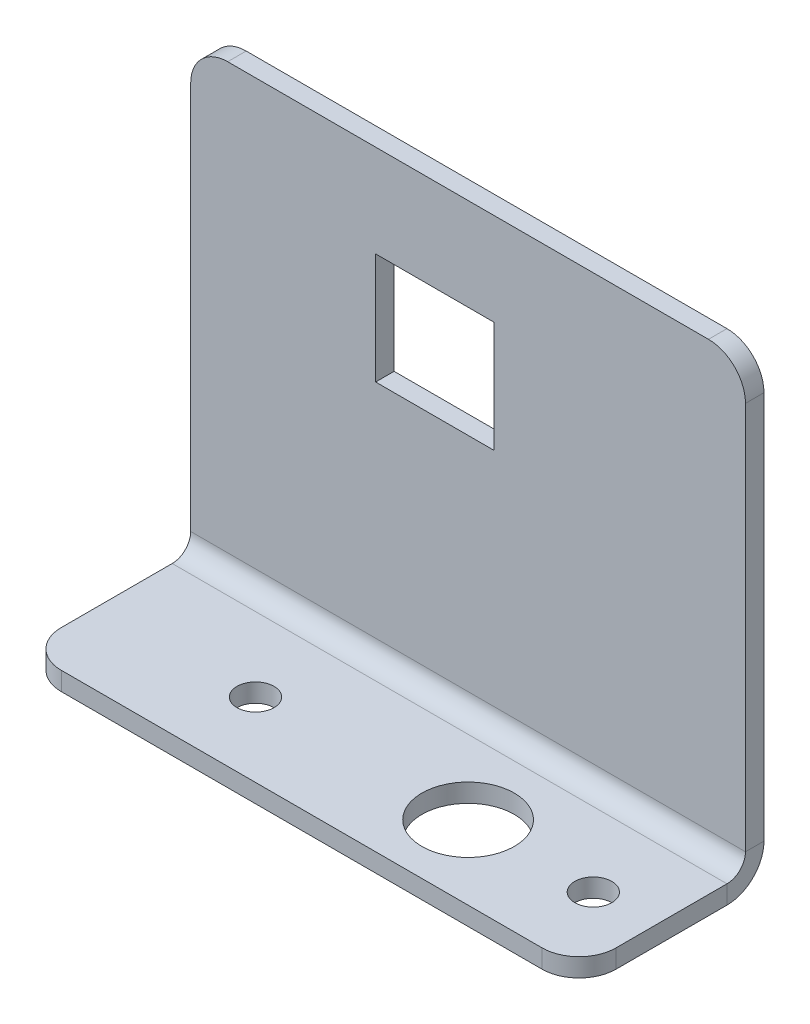
ISO-10303-21;
HEADER;
FILE_DESCRIPTION(('STEP AP214'),'2;1');
FILE_NAME('part.step','',(''),(''),'','','');
FILE_SCHEMA(('AUTOMOTIVE_DESIGN { 1 0 10303 214 1 1 1 1 }'));
ENDSEC;
DATA;
#1=APPLICATION_CONTEXT('core data for automotive mechanical design processes');
#2=APPLICATION_PROTOCOL_DEFINITION('international standard','automotive_design',2000,#1);
#3=PRODUCT_CONTEXT('',#1,'mechanical');
#4=PRODUCT('Part','Part','',(#3));
#5=PRODUCT_RELATED_PRODUCT_CATEGORY('part','',(#4));
#6=PRODUCT_DEFINITION_FORMATION('','',#4);
#7=PRODUCT_DEFINITION_CONTEXT('part definition',#1,'design');
#8=PRODUCT_DEFINITION('design','',#6,#7);
#9=PRODUCT_DEFINITION_SHAPE('','',#8);
#10=(LENGTH_UNIT() NAMED_UNIT(*) SI_UNIT(.MILLI.,.METRE.));
#11=(NAMED_UNIT(*) PLANE_ANGLE_UNIT() SI_UNIT($,.RADIAN.));
#12=(NAMED_UNIT(*) SI_UNIT($,.STERADIAN.) SOLID_ANGLE_UNIT());
#13=UNCERTAINTY_MEASURE_WITH_UNIT(LENGTH_MEASURE(1.E-05),#10,'distance_accuracy_value','');
#14=(GEOMETRIC_REPRESENTATION_CONTEXT(3) GLOBAL_UNCERTAINTY_ASSIGNED_CONTEXT((#13)) GLOBAL_UNIT_ASSIGNED_CONTEXT((#10,
#11,#12)) REPRESENTATION_CONTEXT('',''));
#15=CARTESIAN_POINT('',(0.,0.,0.));
#16=DIRECTION('',(0.,0.,1.));
#17=DIRECTION('',(1.,0.,0.));
#18=AXIS2_PLACEMENT_3D('',#15,#16,#17);
#19=CARTESIAN_POINT('',(0.,1.27,-11.43));
#20=DIRECTION('',(1.,0.,0.));
#21=DIRECTION('',(0.,0.,1.));
#22=AXIS2_PLACEMENT_3D('',#19,#20,#21);
#23=PLANE('',#22);
#24=DIRECTION('',(0.,0.,-1.));
#25=VECTOR('',#24,1.);
#26=CARTESIAN_POINT('',(0.,0.,-11.43));
#27=LINE('',#26,#25);
#28=CARTESIAN_POINT('',(0.,0.,-10.16));
#29=VERTEX_POINT('',#28);
#30=CARTESIAN_POINT('',(0.,0.,-2.54));
#31=VERTEX_POINT('',#30);
#32=EDGE_CURVE('E231',#29,#31,#27,.F.);
#33=ORIENTED_EDGE('',*,*,#32,.T.);
#34=DIRECTION('',(0.,1.,0.));
#35=VECTOR('',#34,1.);
#36=CARTESIAN_POINT('',(0.,1.27,-2.54));
#37=LINE('',#36,#35);
#38=CARTESIAN_POINT('',(0.,1.27,-2.54));
#39=VERTEX_POINT('',#38);
#40=EDGE_CURVE('E273',#31,#39,#37,.T.);
#41=ORIENTED_EDGE('',*,*,#40,.T.);
#42=DIRECTION('',(0.,0.,1.));
#43=VECTOR('',#42,1.);
#44=CARTESIAN_POINT('',(0.,1.27,-11.43));
#45=LINE('',#44,#43);
#46=CARTESIAN_POINT('',(0.,1.27,-10.16));
#47=VERTEX_POINT('',#46);
#48=EDGE_CURVE('E205',#47,#39,#45,.T.);
#49=ORIENTED_EDGE('',*,*,#48,.F.);
#50=DIRECTION('',(0.,1.,0.));
#51=VECTOR('',#50,1.);
#52=CARTESIAN_POINT('',(0.,1.27,-10.16));
#53=LINE('',#52,#51);
#54=EDGE_CURVE('E251',#29,#47,#53,.T.);
#55=ORIENTED_EDGE('',*,*,#54,.F.);
#56=EDGE_LOOP('',(#33,#41,#49,#55));
#57=FACE_BOUND('',#56,.T.);
#58=ADVANCED_FACE('F38',(#57),#23,.F.);
#59=CARTESIAN_POINT('',(38.1,1.27,0.));
#60=DIRECTION('',(0.,0.,1.));
#61=DIRECTION('',(-1.,0.,0.));
#62=AXIS2_PLACEMENT_3D('',#59,#60,#61);
#63=PLANE('',#62);
#64=DIRECTION('',(-1.,0.,0.));
#65=VECTOR('',#64,1.);
#66=CARTESIAN_POINT('',(38.1,1.27,0.));
#67=LINE('',#66,#65);
#68=CARTESIAN_POINT('',(35.56,1.27,0.));
#69=VERTEX_POINT('',#68);
#70=CARTESIAN_POINT('',(2.54000000000001,1.27,0.));
#71=VERTEX_POINT('',#70);
#72=EDGE_CURVE('E299',#69,#71,#67,.T.);
#73=ORIENTED_EDGE('',*,*,#72,.T.);
#74=DIRECTION('',(0.,-1.,0.));
#75=VECTOR('',#74,1.);
#76=CARTESIAN_POINT('',(2.54,1.27,0.));
#77=LINE('',#76,#75);
#78=CARTESIAN_POINT('',(2.54,0.,0.));
#79=VERTEX_POINT('',#78);
#80=EDGE_CURVE('E59',#71,#79,#77,.T.);
#81=ORIENTED_EDGE('',*,*,#80,.T.);
#82=DIRECTION('',(1.,0.,0.));
#83=VECTOR('',#82,1.);
#84=CARTESIAN_POINT('',(38.1,0.,0.));
#85=LINE('',#84,#83);
#86=CARTESIAN_POINT('',(35.56,0.,0.));
#87=VERTEX_POINT('',#86);
#88=EDGE_CURVE('E234',#87,#79,#85,.F.);
#89=ORIENTED_EDGE('',*,*,#88,.F.);
#90=DIRECTION('',(0.,1.,0.));
#91=VECTOR('',#90,1.);
#92=CARTESIAN_POINT('',(35.56,1.27,0.));
#93=LINE('',#92,#91);
#94=EDGE_CURVE('E280',#87,#69,#93,.T.);
#95=ORIENTED_EDGE('',*,*,#94,.T.);
#96=EDGE_LOOP('',(#73,#81,#89,#95));
#97=FACE_BOUND('',#96,.T.);
#98=ADVANCED_FACE('F300',(#97),#63,.T.);
#99=CARTESIAN_POINT('',(38.1,1.27,-11.43));
#100=DIRECTION('',(1.,0.,0.));
#101=DIRECTION('',(0.,0.,1.));
#102=AXIS2_PLACEMENT_3D('',#99,#100,#101);
#103=PLANE('',#102);
#104=DIRECTION('',(0.,0.,1.));
#105=VECTOR('',#104,1.);
#106=CARTESIAN_POINT('',(38.1,1.27,-11.43));
#107=LINE('',#106,#105);
#108=CARTESIAN_POINT('',(38.1,1.27,-10.16));
#109=VERTEX_POINT('',#108);
#110=CARTESIAN_POINT('',(38.1,1.27,-2.54));
#111=VERTEX_POINT('',#110);
#112=EDGE_CURVE('E176',#109,#111,#107,.T.);
#113=ORIENTED_EDGE('',*,*,#112,.T.);
#114=DIRECTION('',(0.,1.,0.));
#115=VECTOR('',#114,1.);
#116=CARTESIAN_POINT('',(38.1,1.27,-2.54));
#117=LINE('',#116,#115);
#118=CARTESIAN_POINT('',(38.1,0.,-2.54));
#119=VERTEX_POINT('',#118);
#120=EDGE_CURVE('E11',#111,#119,#117,.F.);
#121=ORIENTED_EDGE('',*,*,#120,.T.);
#122=DIRECTION('',(0.,0.,-1.));
#123=VECTOR('',#122,1.);
#124=CARTESIAN_POINT('',(38.1,0.,-11.43));
#125=LINE('',#124,#123);
#126=CARTESIAN_POINT('',(38.1,0.,-10.16));
#127=VERTEX_POINT('',#126);
#128=EDGE_CURVE('E214',#127,#119,#125,.F.);
#129=ORIENTED_EDGE('',*,*,#128,.F.);
#130=DIRECTION('',(0.,1.,0.));
#131=VECTOR('',#130,1.);
#132=CARTESIAN_POINT('',(38.1,1.27,-10.16));
#133=LINE('',#132,#131);
#134=EDGE_CURVE('E249',#127,#109,#133,.T.);
#135=ORIENTED_EDGE('',*,*,#134,.T.);
#136=EDGE_LOOP('',(#113,#121,#129,#135));
#137=FACE_BOUND('',#136,.T.);
#138=ADVANCED_FACE('F360',(#137),#103,.T.);
#139=CARTESIAN_POINT('',(38.1,2.54,-10.16));
#140=DIRECTION('',(1.,0.,0.));
#141=DIRECTION('',(0.,0.,-1.));
#142=AXIS2_PLACEMENT_3D('',#139,#140,#141);
#143=PLANE('',#142);
#144=ORIENTED_EDGE('',*,*,#134,.F.);
#145=CARTESIAN_POINT('',(38.1,2.54,-10.16));
#146=DIRECTION('',(1.,0.,0.));
#147=DIRECTION('',(0.,0.,-1.));
#148=AXIS2_PLACEMENT_3D('',#145,#146,#147);
#149=CIRCLE('',#148,2.54);
#150=CARTESIAN_POINT('',(38.1,2.54,-12.7));
#151=VERTEX_POINT('',#150);
#152=EDGE_CURVE('E228',#127,#151,#149,.T.);
#153=ORIENTED_EDGE('',*,*,#152,.T.);
#154=DIRECTION('',(0.,0.,1.));
#155=VECTOR('',#154,1.);
#156=CARTESIAN_POINT('',(38.1,2.54,-11.43));
#157=LINE('',#156,#155);
#158=CARTESIAN_POINT('',(38.1,2.54,-11.43));
#159=VERTEX_POINT('',#158);
#160=EDGE_CURVE('E246',#151,#159,#157,.T.);
#161=ORIENTED_EDGE('',*,*,#160,.T.);
#162=CARTESIAN_POINT('',(38.1,2.54,-10.16));
#163=DIRECTION('',(-1.,0.,0.));
#164=DIRECTION('',(0.,0.,1.));
#165=AXIS2_PLACEMENT_3D('',#162,#163,#164);
#166=CIRCLE('',#165,1.27);
#167=EDGE_CURVE('E201',#109,#159,#166,.F.);
#168=ORIENTED_EDGE('',*,*,#167,.F.);
#169=EDGE_LOOP('',(#144,#153,#161,#168));
#170=FACE_BOUND('',#169,.T.);
#171=ADVANCED_FACE('F387',(#170),#143,.T.);
#172=CARTESIAN_POINT('',(38.1,31.75,-11.43));
#173=DIRECTION('',(1.,0.,0.));
#174=DIRECTION('',(0.,-1.,0.));
#175=AXIS2_PLACEMENT_3D('',#172,#173,#174);
#176=PLANE('',#175);
#177=DIRECTION('',(0.,1.,0.));
#178=VECTOR('',#177,1.);
#179=CARTESIAN_POINT('',(38.1,31.75,-12.7));
#180=LINE('',#179,#178);
#181=CARTESIAN_POINT('',(38.1,29.21,-12.7));
#182=VERTEX_POINT('',#181);
#183=EDGE_CURVE('E224',#182,#151,#180,.F.);
#184=ORIENTED_EDGE('',*,*,#183,.F.);
#185=DIRECTION('',(0.,0.,-1.));
#186=VECTOR('',#185,1.);
#187=CARTESIAN_POINT('',(38.1,29.21,-11.43));
#188=LINE('',#187,#186);
#189=CARTESIAN_POINT('',(38.1,29.21,-11.43));
#190=VERTEX_POINT('',#189);
#191=EDGE_CURVE('E253',#182,#190,#188,.F.);
#192=ORIENTED_EDGE('',*,*,#191,.T.);
#193=DIRECTION('',(0.,-1.,0.));
#194=VECTOR('',#193,1.);
#195=CARTESIAN_POINT('',(38.1,31.75,-11.43));
#196=LINE('',#195,#194);
#197=EDGE_CURVE('E188',#190,#159,#196,.T.);
#198=ORIENTED_EDGE('',*,*,#197,.T.);
#199=ORIENTED_EDGE('',*,*,#160,.F.);
#200=EDGE_LOOP('',(#184,#192,#198,#199));
#201=FACE_BOUND('',#200,.T.);
#202=ADVANCED_FACE('F403',(#201),#176,.T.);
#203=CARTESIAN_POINT('',(38.1,31.75,-11.43));
#204=DIRECTION('',(0.,-1.,0.));
#205=DIRECTION('',(-1.,0.,0.));
#206=AXIS2_PLACEMENT_3D('',#203,#204,#205);
#207=PLANE('',#206);
#208=DIRECTION('',(-1.,0.,0.));
#209=VECTOR('',#208,1.);
#210=CARTESIAN_POINT('',(38.1,31.75,-11.43));
#211=LINE('',#210,#209);
#212=CARTESIAN_POINT('',(35.56,31.75,-11.43));
#213=VERTEX_POINT('',#212);
#214=CARTESIAN_POINT('',(2.54000000000001,31.75,-11.43));
#215=VERTEX_POINT('',#214);
#216=EDGE_CURVE('E190',#213,#215,#211,.T.);
#217=ORIENTED_EDGE('',*,*,#216,.F.);
#218=DIRECTION('',(0.,0.,1.));
#219=VECTOR('',#218,1.);
#220=CARTESIAN_POINT('',(35.56,31.75,-11.43));
#221=LINE('',#220,#219);
#222=CARTESIAN_POINT('',(35.56,31.75,-12.7));
#223=VERTEX_POINT('',#222);
#224=EDGE_CURVE('E265',#213,#223,#221,.F.);
#225=ORIENTED_EDGE('',*,*,#224,.T.);
#226=DIRECTION('',(1.,0.,0.));
#227=VECTOR('',#226,1.);
#228=CARTESIAN_POINT('',(38.1,31.75,-12.7));
#229=LINE('',#228,#227);
#230=CARTESIAN_POINT('',(2.54000000000001,31.75,-12.7));
#231=VERTEX_POINT('',#230);
#232=EDGE_CURVE('E211',#223,#231,#229,.F.);
#233=ORIENTED_EDGE('',*,*,#232,.T.);
#234=DIRECTION('',(0.,0.,-1.));
#235=VECTOR('',#234,1.);
#236=CARTESIAN_POINT('',(2.54,31.75,-11.43));
#237=LINE('',#236,#235);
#238=EDGE_CURVE('E262',#231,#215,#237,.F.);
#239=ORIENTED_EDGE('',*,*,#238,.T.);
#240=EDGE_LOOP('',(#217,#225,#233,#239));
#241=FACE_BOUND('',#240,.T.);
#242=ADVANCED_FACE('F412',(#241),#207,.F.);
#243=CARTESIAN_POINT('',(0.,31.75,-11.43));
#244=DIRECTION('',(1.,0.,0.));
#245=DIRECTION('',(0.,-1.,0.));
#246=AXIS2_PLACEMENT_3D('',#243,#244,#245);
#247=PLANE('',#246);
#248=DIRECTION('',(0.,-1.,0.));
#249=VECTOR('',#248,1.);
#250=CARTESIAN_POINT('',(0.,31.75,-11.43));
#251=LINE('',#250,#249);
#252=CARTESIAN_POINT('',(0.,29.21,-11.43));
#253=VERTEX_POINT('',#252);
#254=CARTESIAN_POINT('',(0.,2.54,-11.43));
#255=VERTEX_POINT('',#254);
#256=EDGE_CURVE('E186',#253,#255,#251,.T.);
#257=ORIENTED_EDGE('',*,*,#256,.F.);
#258=DIRECTION('',(0.,0.,-1.));
#259=VECTOR('',#258,1.);
#260=CARTESIAN_POINT('',(0.,29.21,-11.43));
#261=LINE('',#260,#259);
#262=CARTESIAN_POINT('',(0.,29.21,-12.7));
#263=VERTEX_POINT('',#262);
#264=EDGE_CURVE('E271',#253,#263,#261,.T.);
#265=ORIENTED_EDGE('',*,*,#264,.T.);
#266=DIRECTION('',(0.,1.,0.));
#267=VECTOR('',#266,1.);
#268=CARTESIAN_POINT('',(0.,31.75,-12.7));
#269=LINE('',#268,#267);
#270=CARTESIAN_POINT('',(0.,2.54,-12.7));
#271=VERTEX_POINT('',#270);
#272=EDGE_CURVE('E218',#263,#271,#269,.F.);
#273=ORIENTED_EDGE('',*,*,#272,.T.);
#274=DIRECTION('',(0.,0.,1.));
#275=VECTOR('',#274,1.);
#276=CARTESIAN_POINT('',(0.,2.54,-11.43));
#277=LINE('',#276,#275);
#278=EDGE_CURVE('E244',#271,#255,#277,.T.);
#279=ORIENTED_EDGE('',*,*,#278,.T.);
#280=EDGE_LOOP('',(#257,#265,#273,#279));
#281=FACE_BOUND('',#280,.T.);
#282=ADVANCED_FACE('F409',(#281),#247,.F.);
#283=CARTESIAN_POINT('',(38.1,17.78,-11.43));
#284=DIRECTION('',(0.,-1.,0.));
#285=DIRECTION('',(-1.,0.,0.));
#286=AXIS2_PLACEMENT_3D('',#283,#284,#285);
#287=PLANE('',#286);
#288=DIRECTION('',(0.,0.,1.));
#289=VECTOR('',#288,1.);
#290=CARTESIAN_POINT('',(20.828,17.78,-11.43));
#291=LINE('',#290,#289);
#292=CARTESIAN_POINT('',(20.828,17.78,-12.7));
#293=VERTEX_POINT('',#292);
#294=CARTESIAN_POINT('',(20.828,17.78,-11.43));
#295=VERTEX_POINT('',#294);
#296=EDGE_CURVE('E179',#293,#295,#291,.T.);
#297=ORIENTED_EDGE('',*,*,#296,.F.);
#298=DIRECTION('',(1.,0.,0.));
#299=VECTOR('',#298,1.);
#300=CARTESIAN_POINT('',(38.1,17.78,-12.7));
#301=LINE('',#300,#299);
#302=CARTESIAN_POINT('',(12.7,17.78,-12.7));
#303=VERTEX_POINT('',#302);
#304=EDGE_CURVE('E219',#293,#303,#301,.F.);
#305=ORIENTED_EDGE('',*,*,#304,.T.);
#306=DIRECTION('',(0.,0.,1.));
#307=VECTOR('',#306,1.);
#308=CARTESIAN_POINT('',(12.7,17.78,-11.43));
#309=LINE('',#308,#307);
#310=CARTESIAN_POINT('',(12.7,17.78,-11.43));
#311=VERTEX_POINT('',#310);
#312=EDGE_CURVE('E242',#303,#311,#309,.T.);
#313=ORIENTED_EDGE('',*,*,#312,.T.);
#314=DIRECTION('',(-1.,0.,0.));
#315=VECTOR('',#314,1.);
#316=CARTESIAN_POINT('',(38.1,17.78,-11.43));
#317=LINE('',#316,#315);
#318=EDGE_CURVE('E180',#295,#311,#317,.T.);
#319=ORIENTED_EDGE('',*,*,#318,.F.);
#320=EDGE_LOOP('',(#297,#305,#313,#319));
#321=FACE_BOUND('',#320,.T.);
#322=ADVANCED_FACE('F420',(#321),#287,.F.);
#323=CARTESIAN_POINT('',(12.7,31.75,-11.43));
#324=DIRECTION('',(-1.,0.,0.));
#325=DIRECTION('',(0.,1.,0.));
#326=AXIS2_PLACEMENT_3D('',#323,#324,#325);
#327=PLANE('',#326);
#328=ORIENTED_EDGE('',*,*,#312,.F.);
#329=DIRECTION('',(0.,1.,0.));
#330=VECTOR('',#329,1.);
#331=CARTESIAN_POINT('',(12.7,31.75,-12.7));
#332=LINE('',#331,#330);
#333=CARTESIAN_POINT('',(12.7,25.4,-12.7));
#334=VERTEX_POINT('',#333);
#335=EDGE_CURVE('E215',#303,#334,#332,.T.);
#336=ORIENTED_EDGE('',*,*,#335,.T.);
#337=DIRECTION('',(0.,0.,1.));
#338=VECTOR('',#337,1.);
#339=CARTESIAN_POINT('',(12.7,25.4,-11.43));
#340=LINE('',#339,#338);
#341=CARTESIAN_POINT('',(12.7,25.4,-11.43));
#342=VERTEX_POINT('',#341);
#343=EDGE_CURVE('E164',#334,#342,#340,.T.);
#344=ORIENTED_EDGE('',*,*,#343,.T.);
#345=DIRECTION('',(0.,1.,0.));
#346=VECTOR('',#345,1.);
#347=CARTESIAN_POINT('',(12.7,31.75,-11.43));
#348=LINE('',#347,#346);
#349=EDGE_CURVE('E175',#311,#342,#348,.T.);
#350=ORIENTED_EDGE('',*,*,#349,.F.);
#351=EDGE_LOOP('',(#328,#336,#344,#350));
#352=FACE_BOUND('',#351,.T.);
#353=ADVANCED_FACE('F601',(#352),#327,.F.);
#354=CARTESIAN_POINT('',(38.1,25.4,-11.43));
#355=DIRECTION('',(0.,1.,0.));
#356=DIRECTION('',(1.,0.,0.));
#357=AXIS2_PLACEMENT_3D('',#354,#355,#356);
#358=PLANE('',#357);
#359=ORIENTED_EDGE('',*,*,#343,.F.);
#360=DIRECTION('',(1.,0.,0.));
#361=VECTOR('',#360,1.);
#362=CARTESIAN_POINT('',(38.1,25.4,-12.7));
#363=LINE('',#362,#361);
#364=CARTESIAN_POINT('',(20.828,25.4,-12.7));
#365=VERTEX_POINT('',#364);
#366=EDGE_CURVE('E159',#334,#365,#363,.T.);
#367=ORIENTED_EDGE('',*,*,#366,.T.);
#368=DIRECTION('',(0.,0.,1.));
#369=VECTOR('',#368,1.);
#370=CARTESIAN_POINT('',(20.828,25.4,-11.43));
#371=LINE('',#370,#369);
#372=CARTESIAN_POINT('',(20.828,25.4,-11.43));
#373=VERTEX_POINT('',#372);
#374=EDGE_CURVE('E153',#365,#373,#371,.T.);
#375=ORIENTED_EDGE('',*,*,#374,.T.);
#376=DIRECTION('',(1.,0.,0.));
#377=VECTOR('',#376,1.);
#378=CARTESIAN_POINT('',(38.1,25.4,-11.43));
#379=LINE('',#378,#377);
#380=EDGE_CURVE('E156',#342,#373,#379,.T.);
#381=ORIENTED_EDGE('',*,*,#380,.F.);
#382=EDGE_LOOP('',(#359,#367,#375,#381));
#383=FACE_BOUND('',#382,.T.);
#384=ADVANCED_FACE('F155',(#383),#358,.F.);
#385=CARTESIAN_POINT('',(20.828,31.75,-11.43));
#386=DIRECTION('',(1.,0.,0.));
#387=DIRECTION('',(0.,-1.,0.));
#388=AXIS2_PLACEMENT_3D('',#385,#386,#387);
#389=PLANE('',#388);
#390=DIRECTION('',(0.,1.,0.));
#391=VECTOR('',#390,1.);
#392=CARTESIAN_POINT('',(20.828,31.75,-12.7));
#393=LINE('',#392,#391);
#394=EDGE_CURVE('E213',#365,#293,#393,.F.);
#395=ORIENTED_EDGE('',*,*,#394,.T.);
#396=ORIENTED_EDGE('',*,*,#296,.T.);
#397=DIRECTION('',(0.,-1.,0.));
#398=VECTOR('',#397,1.);
#399=CARTESIAN_POINT('',(20.828,31.75,-11.43));
#400=LINE('',#399,#398);
#401=EDGE_CURVE('E172',#373,#295,#400,.T.);
#402=ORIENTED_EDGE('',*,*,#401,.F.);
#403=ORIENTED_EDGE('',*,*,#374,.F.);
#404=EDGE_LOOP('',(#395,#396,#402,#403));
#405=FACE_BOUND('',#404,.T.);
#406=ADVANCED_FACE('F178',(#405),#389,.F.);
#407=CARTESIAN_POINT('',(0.,2.54,-10.16));
#408=DIRECTION('',(-1.,0.,0.));
#409=DIRECTION('',(0.,0.,1.));
#410=AXIS2_PLACEMENT_3D('',#407,#408,#409);
#411=PLANE('',#410);
#412=CARTESIAN_POINT('',(0.,2.54,-10.16));
#413=DIRECTION('',(1.,0.,0.));
#414=DIRECTION('',(0.,0.,-1.));
#415=AXIS2_PLACEMENT_3D('',#412,#413,#414);
#416=CIRCLE('',#415,2.54);
#417=EDGE_CURVE('E232',#271,#29,#416,.F.);
#418=ORIENTED_EDGE('',*,*,#417,.T.);
#419=ORIENTED_EDGE('',*,*,#54,.T.);
#420=CARTESIAN_POINT('',(0.,2.54,-10.16));
#421=DIRECTION('',(1.,0.,0.));
#422=DIRECTION('',(0.,0.,-1.));
#423=AXIS2_PLACEMENT_3D('',#420,#421,#422);
#424=CIRCLE('',#423,1.27);
#425=EDGE_CURVE('E198',#255,#47,#424,.F.);
#426=ORIENTED_EDGE('',*,*,#425,.F.);
#427=ORIENTED_EDGE('',*,*,#278,.F.);
#428=EDGE_LOOP('',(#418,#419,#426,#427));
#429=FACE_BOUND('',#428,.T.);
#430=ADVANCED_FACE('F352',(#429),#411,.T.);
#431=CARTESIAN_POINT('',(38.1,31.75,-11.43));
#432=DIRECTION('',(0.,0.,-1.));
#433=DIRECTION('',(0.,1.,0.));
#434=AXIS2_PLACEMENT_3D('',#431,#432,#433);
#435=PLANE('',#434);
#436=ORIENTED_EDGE('',*,*,#380,.T.);
#437=ORIENTED_EDGE('',*,*,#401,.T.);
#438=ORIENTED_EDGE('',*,*,#318,.T.);
#439=ORIENTED_EDGE('',*,*,#349,.T.);
#440=EDGE_LOOP('',(#436,#437,#438,#439));
#441=FACE_BOUND('',#440,.T.);
#442=ORIENTED_EDGE('',*,*,#197,.F.);
#443=CARTESIAN_POINT('',(35.56,29.21,-11.43));
#444=DIRECTION('',(0.,0.,-1.));
#445=DIRECTION('',(0.,1.,0.));
#446=AXIS2_PLACEMENT_3D('',#443,#444,#445);
#447=CIRCLE('',#446,2.54);
#448=EDGE_CURVE('E260',#190,#213,#447,.F.);
#449=ORIENTED_EDGE('',*,*,#448,.T.);
#450=ORIENTED_EDGE('',*,*,#216,.T.);
#451=CARTESIAN_POINT('',(2.54,29.21,-11.43));
#452=DIRECTION('',(0.,0.,-1.));
#453=DIRECTION('',(0.,1.,0.));
#454=AXIS2_PLACEMENT_3D('',#451,#452,#453);
#455=CIRCLE('',#454,2.54);
#456=EDGE_CURVE('E258',#215,#253,#455,.F.);
#457=ORIENTED_EDGE('',*,*,#456,.T.);
#458=ORIENTED_EDGE('',*,*,#256,.T.);
#459=DIRECTION('',(-1.,0.,0.));
#460=VECTOR('',#459,1.);
#461=CARTESIAN_POINT('',(38.1,2.54,-11.43));
#462=LINE('',#461,#460);
#463=EDGE_CURVE('E165',#255,#159,#462,.F.);
#464=ORIENTED_EDGE('',*,*,#463,.T.);
#465=EDGE_LOOP('',(#442,#449,#450,#457,#458,#464));
#466=FACE_BOUND('',#465,.T.);
#467=ADVANCED_FACE('F169',(#441,#466),#435,.F.);
#468=CARTESIAN_POINT('',(38.1,1.27,-11.43));
#469=DIRECTION('',(0.,-1.,0.));
#470=DIRECTION('',(0.,0.,-1.));
#471=AXIS2_PLACEMENT_3D('',#468,#469,#470);
#472=PLANE('',#471);
#473=CARTESIAN_POINT('',(34.,1.27,-5.07999999999999));
#474=DIRECTION('',(0.,-1.,0.));
#475=DIRECTION('',(0.,0.,-1.));
#476=AXIS2_PLACEMENT_3D('',#473,#474,#475);
#477=CIRCLE('',#476,1.27);
#478=CARTESIAN_POINT('',(34.,1.27,-6.34999999999998));
#479=VERTEX_POINT('',#478);
#480=EDGE_CURVE('E316',#479,#479,#477,.T.);
#481=ORIENTED_EDGE('',*,*,#480,.T.);
#482=EDGE_LOOP('',(#481));
#483=FACE_BOUND('',#482,.T.);
#484=CARTESIAN_POINT('',(10.8,1.27,-5.07999999999999));
#485=DIRECTION('',(0.,-1.,0.));
#486=DIRECTION('',(0.,0.,-1.));
#487=AXIS2_PLACEMENT_3D('',#484,#485,#486);
#488=CIRCLE('',#487,1.27);
#489=CARTESIAN_POINT('',(10.8,1.27,-6.34999999999999));
#490=VERTEX_POINT('',#489);
#491=EDGE_CURVE('E310',#490,#490,#488,.T.);
#492=ORIENTED_EDGE('',*,*,#491,.T.);
#493=EDGE_LOOP('',(#492));
#494=FACE_BOUND('',#493,.T.);
#495=CARTESIAN_POINT('',(25.4,1.27,-5.08));
#496=DIRECTION('',(0.,-1.,0.));
#497=DIRECTION('',(0.,0.,-1.));
#498=AXIS2_PLACEMENT_3D('',#495,#496,#497);
#499=CIRCLE('',#498,3.17500000000001);
#500=CARTESIAN_POINT('',(25.4,1.27,-8.25500000000001));
#501=VERTEX_POINT('',#500);
#502=EDGE_CURVE('E240',#501,#501,#499,.T.);
#503=ORIENTED_EDGE('',*,*,#502,.T.);
#504=EDGE_LOOP('',(#503));
#505=FACE_BOUND('',#504,.T.);
#506=ORIENTED_EDGE('',*,*,#48,.T.);
#507=CARTESIAN_POINT('',(2.54,1.27,-2.54));
#508=DIRECTION('',(0.,-1.,0.));
#509=DIRECTION('',(0.,0.,-1.));
#510=AXIS2_PLACEMENT_3D('',#507,#508,#509);
#511=CIRCLE('',#510,2.54);
#512=EDGE_CURVE('E278',#39,#71,#511,.F.);
#513=ORIENTED_EDGE('',*,*,#512,.T.);
#514=ORIENTED_EDGE('',*,*,#72,.F.);
#515=CARTESIAN_POINT('',(35.56,1.27,-2.54));
#516=DIRECTION('',(0.,-1.,0.));
#517=DIRECTION('',(0.,0.,-1.));
#518=AXIS2_PLACEMENT_3D('',#515,#516,#517);
#519=CIRCLE('',#518,2.54);
#520=EDGE_CURVE('E276',#69,#111,#519,.F.);
#521=ORIENTED_EDGE('',*,*,#520,.T.);
#522=ORIENTED_EDGE('',*,*,#112,.F.);
#523=DIRECTION('',(-1.,0.,0.));
#524=VECTOR('',#523,1.);
#525=CARTESIAN_POINT('',(0.,1.27,-10.16));
#526=LINE('',#525,#524);
#527=EDGE_CURVE('E193',#109,#47,#526,.T.);
#528=ORIENTED_EDGE('',*,*,#527,.T.);
#529=EDGE_LOOP('',(#506,#513,#514,#521,#522,#528));
#530=FACE_BOUND('',#529,.T.);
#531=ADVANCED_FACE('F298',(#483,#494,#505,#530),#472,.F.);
#532=CARTESIAN_POINT('',(38.1,2.54,-10.16));
#533=DIRECTION('',(1.,0.,0.));
#534=DIRECTION('',(0.,0.,-1.));
#535=AXIS2_PLACEMENT_3D('',#532,#533,#534);
#536=CYLINDRICAL_SURFACE('',#535,1.27);
#537=ORIENTED_EDGE('',*,*,#167,.T.);
#538=ORIENTED_EDGE('',*,*,#463,.F.);
#539=ORIENTED_EDGE('',*,*,#425,.T.);
#540=ORIENTED_EDGE('',*,*,#527,.F.);
#541=EDGE_LOOP('',(#537,#538,#539,#540));
#542=FACE_BOUND('',#541,.T.);
#543=ADVANCED_FACE('F343',(#542),#536,.F.);
#544=CARTESIAN_POINT('',(38.1,31.75,-12.7));
#545=DIRECTION('',(0.,0.,-1.));
#546=DIRECTION('',(0.,1.,0.));
#547=AXIS2_PLACEMENT_3D('',#544,#545,#546);
#548=PLANE('',#547);
#549=ORIENTED_EDGE('',*,*,#366,.F.);
#550=ORIENTED_EDGE('',*,*,#335,.F.);
#551=ORIENTED_EDGE('',*,*,#304,.F.);
#552=ORIENTED_EDGE('',*,*,#394,.F.);
#553=EDGE_LOOP('',(#549,#550,#551,#552));
#554=FACE_BOUND('',#553,.T.);
#555=ORIENTED_EDGE('',*,*,#232,.F.);
#556=CARTESIAN_POINT('',(35.56,29.21,-12.7));
#557=DIRECTION('',(0.,0.,-1.));
#558=DIRECTION('',(0.,1.,0.));
#559=AXIS2_PLACEMENT_3D('',#556,#557,#558);
#560=CIRCLE('',#559,2.54);
#561=EDGE_CURVE('E269',#223,#182,#560,.T.);
#562=ORIENTED_EDGE('',*,*,#561,.T.);
#563=ORIENTED_EDGE('',*,*,#183,.T.);
#564=DIRECTION('',(1.,0.,0.));
#565=VECTOR('',#564,1.);
#566=CARTESIAN_POINT('',(38.1,2.54,-12.7));
#567=LINE('',#566,#565);
#568=EDGE_CURVE('E202',#271,#151,#567,.T.);
#569=ORIENTED_EDGE('',*,*,#568,.F.);
#570=ORIENTED_EDGE('',*,*,#272,.F.);
#571=CARTESIAN_POINT('',(2.54,29.21,-12.7));
#572=DIRECTION('',(0.,0.,-1.));
#573=DIRECTION('',(0.,1.,0.));
#574=AXIS2_PLACEMENT_3D('',#571,#572,#573);
#575=CIRCLE('',#574,2.54);
#576=EDGE_CURVE('E267',#263,#231,#575,.T.);
#577=ORIENTED_EDGE('',*,*,#576,.T.);
#578=EDGE_LOOP('',(#555,#562,#563,#569,#570,#577));
#579=FACE_BOUND('',#578,.T.);
#580=ADVANCED_FACE('F329',(#554,#579),#548,.T.);
#581=CARTESIAN_POINT('',(38.1,0.,-11.43));
#582=DIRECTION('',(0.,-1.,0.));
#583=DIRECTION('',(0.,0.,-1.));
#584=AXIS2_PLACEMENT_3D('',#581,#582,#583);
#585=PLANE('',#584);
#586=CARTESIAN_POINT('',(34.,0.,-5.07999999999999));
#587=DIRECTION('',(0.,-1.,0.));
#588=DIRECTION('',(0.,0.,-1.));
#589=AXIS2_PLACEMENT_3D('',#586,#587,#588);
#590=CIRCLE('',#589,1.27);
#591=CARTESIAN_POINT('',(34.,0.,-6.34999999999998));
#592=VERTEX_POINT('',#591);
#593=EDGE_CURVE('E319',#592,#592,#590,.T.);
#594=ORIENTED_EDGE('',*,*,#593,.F.);
#595=EDGE_LOOP('',(#594));
#596=FACE_BOUND('',#595,.T.);
#597=CARTESIAN_POINT('',(10.8,0.,-5.07999999999999));
#598=DIRECTION('',(0.,-1.,0.));
#599=DIRECTION('',(0.,0.,-1.));
#600=AXIS2_PLACEMENT_3D('',#597,#598,#599);
#601=CIRCLE('',#600,1.27);
#602=CARTESIAN_POINT('',(10.8,0.,-6.34999999999999));
#603=VERTEX_POINT('',#602);
#604=EDGE_CURVE('E313',#603,#603,#601,.T.);
#605=ORIENTED_EDGE('',*,*,#604,.F.);
#606=EDGE_LOOP('',(#605));
#607=FACE_BOUND('',#606,.T.);
#608=CARTESIAN_POINT('',(25.4,0.,-5.08));
#609=DIRECTION('',(0.,-1.,0.));
#610=DIRECTION('',(0.,0.,-1.));
#611=AXIS2_PLACEMENT_3D('',#608,#609,#610);
#612=CIRCLE('',#611,3.17500000000001);
#613=CARTESIAN_POINT('',(25.4,0.,-8.25500000000001));
#614=VERTEX_POINT('',#613);
#615=EDGE_CURVE('E307',#614,#614,#612,.T.);
#616=ORIENTED_EDGE('',*,*,#615,.F.);
#617=EDGE_LOOP('',(#616));
#618=FACE_BOUND('',#617,.T.);
#619=ORIENTED_EDGE('',*,*,#88,.T.);
#620=CARTESIAN_POINT('',(2.54,0.,-2.54));
#621=DIRECTION('',(0.,-1.,0.));
#622=DIRECTION('',(0.,0.,-1.));
#623=AXIS2_PLACEMENT_3D('',#620,#621,#622);
#624=CIRCLE('',#623,2.54);
#625=EDGE_CURVE('E46',#79,#31,#624,.T.);
#626=ORIENTED_EDGE('',*,*,#625,.T.);
#627=ORIENTED_EDGE('',*,*,#32,.F.);
#628=DIRECTION('',(1.,0.,0.));
#629=VECTOR('',#628,1.);
#630=CARTESIAN_POINT('',(38.1,0.,-10.16));
#631=LINE('',#630,#629);
#632=EDGE_CURVE('E208',#127,#29,#631,.F.);
#633=ORIENTED_EDGE('',*,*,#632,.F.);
#634=ORIENTED_EDGE('',*,*,#128,.T.);
#635=CARTESIAN_POINT('',(35.56,0.,-2.54));
#636=DIRECTION('',(0.,-1.,0.));
#637=DIRECTION('',(0.,0.,-1.));
#638=AXIS2_PLACEMENT_3D('',#635,#636,#637);
#639=CIRCLE('',#638,2.54);
#640=EDGE_CURVE('E284',#119,#87,#639,.T.);
#641=ORIENTED_EDGE('',*,*,#640,.T.);
#642=EDGE_LOOP('',(#619,#626,#627,#633,#634,#641));
#643=FACE_BOUND('',#642,.T.);
#644=ADVANCED_FACE('F288',(#596,#607,#618,#643),#585,.T.);
#645=CARTESIAN_POINT('',(38.1,2.54,-10.16));
#646=DIRECTION('',(1.,0.,0.));
#647=DIRECTION('',(0.,0.,-1.));
#648=AXIS2_PLACEMENT_3D('',#645,#646,#647);
#649=CYLINDRICAL_SURFACE('',#648,2.54);
#650=ORIENTED_EDGE('',*,*,#152,.F.);
#651=ORIENTED_EDGE('',*,*,#632,.T.);
#652=ORIENTED_EDGE('',*,*,#417,.F.);
#653=ORIENTED_EDGE('',*,*,#568,.T.);
#654=EDGE_LOOP('',(#650,#651,#652,#653));
#655=FACE_BOUND('',#654,.T.);
#656=ADVANCED_FACE('F328',(#655),#649,.T.);
#657=CARTESIAN_POINT('',(35.56,29.21,-11.43));
#658=DIRECTION('',(0.,0.,-1.));
#659=DIRECTION('',(0.,1.,0.));
#660=AXIS2_PLACEMENT_3D('',#657,#658,#659);
#661=CYLINDRICAL_SURFACE('',#660,2.54);
#662=ORIENTED_EDGE('',*,*,#561,.F.);
#663=ORIENTED_EDGE('',*,*,#224,.F.);
#664=ORIENTED_EDGE('',*,*,#448,.F.);
#665=ORIENTED_EDGE('',*,*,#191,.F.);
#666=EDGE_LOOP('',(#662,#663,#664,#665));
#667=FACE_BOUND('',#666,.T.);
#668=ADVANCED_FACE('F367',(#667),#661,.T.);
#669=CARTESIAN_POINT('',(2.54,29.21,-11.43));
#670=DIRECTION('',(0.,0.,1.));
#671=DIRECTION('',(0.,-1.,0.));
#672=AXIS2_PLACEMENT_3D('',#669,#670,#671);
#673=CYLINDRICAL_SURFACE('',#672,2.54);
#674=ORIENTED_EDGE('',*,*,#576,.F.);
#675=ORIENTED_EDGE('',*,*,#264,.F.);
#676=ORIENTED_EDGE('',*,*,#456,.F.);
#677=ORIENTED_EDGE('',*,*,#238,.F.);
#678=EDGE_LOOP('',(#674,#675,#676,#677));
#679=FACE_BOUND('',#678,.T.);
#680=ADVANCED_FACE('F370',(#679),#673,.T.);
#681=CARTESIAN_POINT('',(2.54,1.27,-2.54));
#682=DIRECTION('',(0.,-1.,0.));
#683=DIRECTION('',(0.,0.,-1.));
#684=AXIS2_PLACEMENT_3D('',#681,#682,#683);
#685=CYLINDRICAL_SURFACE('',#684,2.54);
#686=ORIENTED_EDGE('',*,*,#625,.F.);
#687=ORIENTED_EDGE('',*,*,#80,.F.);
#688=ORIENTED_EDGE('',*,*,#512,.F.);
#689=ORIENTED_EDGE('',*,*,#40,.F.);
#690=EDGE_LOOP('',(#686,#687,#688,#689));
#691=FACE_BOUND('',#690,.T.);
#692=ADVANCED_FACE('F295',(#691),#685,.T.);
#693=CARTESIAN_POINT('',(35.56,1.27,-2.54));
#694=DIRECTION('',(0.,1.,0.));
#695=DIRECTION('',(0.,0.,1.));
#696=AXIS2_PLACEMENT_3D('',#693,#694,#695);
#697=CYLINDRICAL_SURFACE('',#696,2.54);
#698=ORIENTED_EDGE('',*,*,#640,.F.);
#699=ORIENTED_EDGE('',*,*,#120,.F.);
#700=ORIENTED_EDGE('',*,*,#520,.F.);
#701=ORIENTED_EDGE('',*,*,#94,.F.);
#702=EDGE_LOOP('',(#698,#699,#700,#701));
#703=FACE_BOUND('',#702,.T.);
#704=ADVANCED_FACE('F40',(#703),#697,.T.);
#705=CARTESIAN_POINT('',(25.4,31.75,-5.08));
#706=DIRECTION('',(0.,-1.,0.));
#707=DIRECTION('',(0.,0.,-1.));
#708=AXIS2_PLACEMENT_3D('',#705,#706,#707);
#709=CYLINDRICAL_SURFACE('',#708,3.17500000000001);
#710=ORIENTED_EDGE('',*,*,#615,.T.);
#711=EDGE_LOOP('',(#710));
#712=FACE_BOUND('',#711,.T.);
#713=ORIENTED_EDGE('',*,*,#502,.F.);
#714=EDGE_LOOP('',(#713));
#715=FACE_BOUND('',#714,.T.);
#716=ADVANCED_FACE('F335',(#712,#715),#709,.F.);
#717=CARTESIAN_POINT('',(10.8,31.75,-5.07999999999998));
#718=DIRECTION('',(0.,-1.,0.));
#719=DIRECTION('',(0.,0.,-1.));
#720=AXIS2_PLACEMENT_3D('',#717,#718,#719);
#721=CYLINDRICAL_SURFACE('',#720,1.27);
#722=ORIENTED_EDGE('',*,*,#604,.T.);
#723=EDGE_LOOP('',(#722));
#724=FACE_BOUND('',#723,.T.);
#725=ORIENTED_EDGE('',*,*,#491,.F.);
#726=EDGE_LOOP('',(#725));
#727=FACE_BOUND('',#726,.T.);
#728=ADVANCED_FACE('F338',(#724,#727),#721,.F.);
#729=CARTESIAN_POINT('',(34.,31.75,-5.07999999999998));
#730=DIRECTION('',(0.,-1.,0.));
#731=DIRECTION('',(0.,0.,-1.));
#732=AXIS2_PLACEMENT_3D('',#729,#730,#731);
#733=CYLINDRICAL_SURFACE('',#732,1.27);
#734=ORIENTED_EDGE('',*,*,#593,.T.);
#735=EDGE_LOOP('',(#734));
#736=FACE_BOUND('',#735,.T.);
#737=ORIENTED_EDGE('',*,*,#480,.F.);
#738=EDGE_LOOP('',(#737));
#739=FACE_BOUND('',#738,.T.);
#740=ADVANCED_FACE('F323',(#736,#739),#733,.F.);
#741=CLOSED_SHELL('',(#58,#98,#138,#171,#202,#242,#282,#322,#353,#384,#406,#430,#467,#531,#543,
#580,#644,#656,#668,#680,#692,#704,#716,#728,#740));
#742=MANIFOLD_SOLID_BREP('B2',#741);
#743=ADVANCED_BREP_SHAPE_REPRESENTATION('',(#18,#742),#14);
#744=SHAPE_DEFINITION_REPRESENTATION(#9,#743);
ENDSEC;
END-ISO-10303-21;
